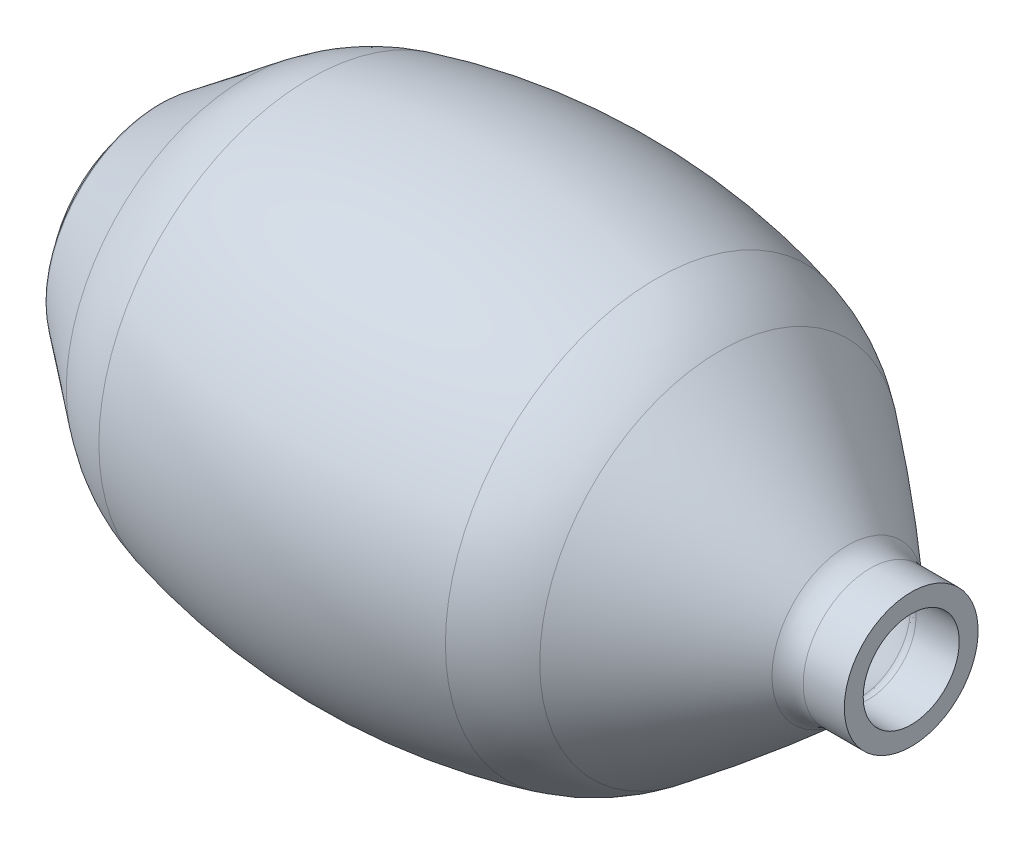
ISO-10303-21;
HEADER;
FILE_DESCRIPTION(('STEP AP214'),'2;1');
FILE_NAME('part.step','',(''),(''),'','','');
FILE_SCHEMA(('AUTOMOTIVE_DESIGN { 1 0 10303 214 1 1 1 1 }'));
ENDSEC;
DATA;
#1=APPLICATION_CONTEXT('core data for automotive mechanical design processes');
#2=APPLICATION_PROTOCOL_DEFINITION('international standard','automotive_design',2000,#1);
#3=PRODUCT_CONTEXT('',#1,'mechanical');
#4=PRODUCT('Part','Part','',(#3));
#5=PRODUCT_RELATED_PRODUCT_CATEGORY('part','',(#4));
#6=PRODUCT_DEFINITION_FORMATION('','',#4);
#7=PRODUCT_DEFINITION_CONTEXT('part definition',#1,'design');
#8=PRODUCT_DEFINITION('design','',#6,#7);
#9=PRODUCT_DEFINITION_SHAPE('','',#8);
#10=(LENGTH_UNIT() NAMED_UNIT(*) SI_UNIT(.MILLI.,.METRE.));
#11=(NAMED_UNIT(*) PLANE_ANGLE_UNIT() SI_UNIT($,.RADIAN.));
#12=(NAMED_UNIT(*) SI_UNIT($,.STERADIAN.) SOLID_ANGLE_UNIT());
#13=UNCERTAINTY_MEASURE_WITH_UNIT(LENGTH_MEASURE(1.E-05),#10,'distance_accuracy_value','');
#14=(GEOMETRIC_REPRESENTATION_CONTEXT(3) GLOBAL_UNCERTAINTY_ASSIGNED_CONTEXT((#13)) GLOBAL_UNIT_ASSIGNED_CONTEXT((#10,
#11,#12)) REPRESENTATION_CONTEXT('',''));
#15=CARTESIAN_POINT('',(0.,0.,0.));
#16=DIRECTION('',(0.,0.,1.));
#17=DIRECTION('',(1.,0.,0.));
#18=AXIS2_PLACEMENT_3D('',#15,#16,#17);
#19=CARTESIAN_POINT('',(37.4010395541845,0.,0.));
#20=DIRECTION('',(-1.,0.,0.));
#21=DIRECTION('',(0.,0.,1.));
#22=AXIS2_PLACEMENT_3D('',#19,#20,#21);
#23=DEGENERATE_TOROIDAL_SURFACE('',#22,11.060470194713,52.1126561570169,.T.);
#24=CARTESIAN_POINT('',(50.5,0.,0.));
#25=DIRECTION('',(-1.,0.,0.));
#26=DIRECTION('',(0.,0.,1.));
#27=AXIS2_PLACEMENT_3D('',#24,#25,#26);
#28=CIRCLE('',#27,61.5);
#29=CARTESIAN_POINT('',(50.5,0.,61.5));
#30=VERTEX_POINT('',#29);
#31=EDGE_CURVE('E10',#30,#30,#28,.T.);
#32=ORIENTED_EDGE('',*,*,#31,.F.);
#33=EDGE_LOOP('',(#32));
#34=FACE_BOUND('',#33,.T.);
#35=CARTESIAN_POINT('',(69.0000000000001,0.,0.));
#36=DIRECTION('',(-1.,0.,0.));
#37=DIRECTION('',(0.,0.,1.));
#38=AXIS2_PLACEMENT_3D('',#35,#36,#37);
#39=CIRCLE('',#38,52.5);
#40=CARTESIAN_POINT('',(69.0000000000001,0.,52.5));
#41=VERTEX_POINT('',#40);
#42=EDGE_CURVE('E126',#41,#41,#39,.T.);
#43=ORIENTED_EDGE('',*,*,#42,.T.);
#44=EDGE_LOOP('',(#43));
#45=FACE_BOUND('',#44,.T.);
#46=ADVANCED_FACE('F32',(#34,#45),#23,.T.);
#47=CARTESIAN_POINT('',(0.,0.,0.));
#48=DIRECTION('',(-1.,0.,0.));
#49=DIRECTION('',(0.,0.,1.));
#50=AXIS2_PLACEMENT_3D('',#47,#48,#49);
#51=DEGENERATE_TOROIDAL_SURFACE('',#50,132.957893487317,200.908243582797,.F.);
#52=CARTESIAN_POINT('',(-50.5,0.,0.));
#53=DIRECTION('',(-1.,0.,0.));
#54=DIRECTION('',(0.,0.,1.));
#55=AXIS2_PLACEMENT_3D('',#52,#53,#54);
#56=CIRCLE('',#55,61.5);
#57=CARTESIAN_POINT('',(-50.5,0.,61.5));
#58=VERTEX_POINT('',#57);
#59=EDGE_CURVE('E38',#58,#58,#56,.T.);
#60=ORIENTED_EDGE('',*,*,#59,.F.);
#61=EDGE_LOOP('',(#60));
#62=FACE_BOUND('',#61,.T.);
#63=ORIENTED_EDGE('',*,*,#31,.T.);
#64=EDGE_LOOP('',(#63));
#65=FACE_BOUND('',#64,.T.);
#66=ADVANCED_FACE('F295',(#62,#65),#51,.F.);
#67=CARTESIAN_POINT('',(-37.4010395541845,0.,0.));
#68=DIRECTION('',(-1.,0.,0.));
#69=DIRECTION('',(0.,0.,1.));
#70=AXIS2_PLACEMENT_3D('',#67,#68,#69);
#71=DEGENERATE_TOROIDAL_SURFACE('',#70,11.060470194713,52.1126561570169,.T.);
#72=CARTESIAN_POINT('',(-69.,0.,0.));
#73=DIRECTION('',(-1.,0.,0.));
#74=DIRECTION('',(0.,0.,1.));
#75=AXIS2_PLACEMENT_3D('',#72,#73,#74);
#76=CIRCLE('',#75,52.5);
#77=CARTESIAN_POINT('',(-69.,0.,52.5));
#78=VERTEX_POINT('',#77);
#79=EDGE_CURVE('E42',#78,#78,#76,.T.);
#80=ORIENTED_EDGE('',*,*,#79,.F.);
#81=EDGE_LOOP('',(#80));
#82=FACE_BOUND('',#81,.T.);
#83=ORIENTED_EDGE('',*,*,#59,.T.);
#84=EDGE_LOOP('',(#83));
#85=FACE_BOUND('',#84,.T.);
#86=ADVANCED_FACE('F290',(#82,#85),#71,.T.);
#87=CARTESIAN_POINT('',(-69.,0.,0.));
#88=DIRECTION('',(1.,0.,0.));
#89=DIRECTION('',(0.,0.,-1.));
#90=AXIS2_PLACEMENT_3D('',#87,#88,#89);
#91=CONICAL_SURFACE('',#90,52.5,0.651473354019808);
#92=CARTESIAN_POINT('',(-93.6538480001091,0.,0.));
#93=DIRECTION('',(-1.,0.,0.));
#94=DIRECTION('',(0.,0.,1.));
#95=AXIS2_PLACEMENT_3D('',#92,#93,#94);
#96=CIRCLE('',#95,33.7006561982466);
#97=CARTESIAN_POINT('',(-93.6538480001091,0.,33.7006561982466));
#98=VERTEX_POINT('',#97);
#99=EDGE_CURVE('E46',#98,#98,#96,.T.);
#100=ORIENTED_EDGE('',*,*,#99,.F.);
#101=EDGE_LOOP('',(#100));
#102=FACE_BOUND('',#101,.T.);
#103=ORIENTED_EDGE('',*,*,#79,.T.);
#104=EDGE_LOOP('',(#103));
#105=FACE_BOUND('',#104,.T.);
#106=ADVANCED_FACE('F284',(#102,#105),#91,.T.);
#107=CARTESIAN_POINT('',(-91.2284133532466,0.,0.));
#108=DIRECTION('',(-1.,0.,0.));
#109=DIRECTION('',(0.,0.,1.));
#110=AXIS2_PLACEMENT_3D('',#107,#108,#109);
#111=TOROIDAL_SURFACE('',#110,30.5198910742868,4.);
#112=CARTESIAN_POINT('',(-95.2284133532466,0.,0.));
#113=DIRECTION('',(-1.,0.,0.));
#114=DIRECTION('',(0.,0.,1.));
#115=AXIS2_PLACEMENT_3D('',#112,#113,#114);
#116=CIRCLE('',#115,30.5198910742868);
#117=CARTESIAN_POINT('',(-95.2284133532466,0.,30.5198910742868));
#118=VERTEX_POINT('',#117);
#119=EDGE_CURVE('E51',#118,#118,#116,.T.);
#120=ORIENTED_EDGE('',*,*,#119,.F.);
#121=EDGE_LOOP('',(#120));
#122=FACE_BOUND('',#121,.T.);
#123=ORIENTED_EDGE('',*,*,#99,.T.);
#124=EDGE_LOOP('',(#123));
#125=FACE_BOUND('',#124,.T.);
#126=ADVANCED_FACE('F278',(#122,#125),#111,.T.);
#127=CARTESIAN_POINT('',(-95.2284133532466,0.,-30.5198910742868));
#128=DIRECTION('',(1.,0.,0.));
#129=DIRECTION('',(0.,0.,-1.));
#130=AXIS2_PLACEMENT_3D('',#127,#128,#129);
#131=PLANE('',#130);
#132=CARTESIAN_POINT('',(-95.2284133532466,0.,0.));
#133=DIRECTION('',(-1.,0.,0.));
#134=DIRECTION('',(0.,0.,1.));
#135=AXIS2_PLACEMENT_3D('',#132,#133,#134);
#136=CIRCLE('',#135,28.);
#137=CARTESIAN_POINT('',(-95.2284133532466,0.,28.));
#138=VERTEX_POINT('',#137);
#139=EDGE_CURVE('E54',#138,#138,#136,.T.);
#140=ORIENTED_EDGE('',*,*,#139,.F.);
#141=EDGE_LOOP('',(#140));
#142=FACE_BOUND('',#141,.T.);
#143=ORIENTED_EDGE('',*,*,#119,.T.);
#144=EDGE_LOOP('',(#143));
#145=FACE_BOUND('',#144,.T.);
#146=ADVANCED_FACE('F272',(#142,#145),#131,.F.);
#147=CARTESIAN_POINT('',(0.,0.,0.));
#148=DIRECTION('',(-1.,0.,0.));
#149=DIRECTION('',(0.,0.,1.));
#150=AXIS2_PLACEMENT_3D('',#147,#148,#149);
#151=CYLINDRICAL_SURFACE('',#150,28.);
#152=CARTESIAN_POINT('',(-98.2284133532466,0.,0.));
#153=DIRECTION('',(-1.,0.,0.));
#154=DIRECTION('',(0.,0.,1.));
#155=AXIS2_PLACEMENT_3D('',#152,#153,#154);
#156=CIRCLE('',#155,28.);
#157=CARTESIAN_POINT('',(-98.2284133532466,0.,28.));
#158=VERTEX_POINT('',#157);
#159=EDGE_CURVE('E57',#158,#158,#156,.T.);
#160=ORIENTED_EDGE('',*,*,#159,.F.);
#161=EDGE_LOOP('',(#160));
#162=FACE_BOUND('',#161,.T.);
#163=ORIENTED_EDGE('',*,*,#139,.T.);
#164=EDGE_LOOP('',(#163));
#165=FACE_BOUND('',#164,.T.);
#166=ADVANCED_FACE('F266',(#162,#165),#151,.T.);
#167=CARTESIAN_POINT('',(-98.2284133532466,0.,-28.));
#168=DIRECTION('',(1.,0.,0.));
#169=DIRECTION('',(0.,0.,-1.));
#170=AXIS2_PLACEMENT_3D('',#167,#168,#169);
#171=PLANE('',#170);
#172=CARTESIAN_POINT('',(-98.2284133532466,0.,0.));
#173=DIRECTION('',(-1.,0.,0.));
#174=DIRECTION('',(0.,0.,1.));
#175=AXIS2_PLACEMENT_3D('',#172,#173,#174);
#176=CIRCLE('',#175,25.5);
#177=CARTESIAN_POINT('',(-98.2284133532466,0.,25.5));
#178=VERTEX_POINT('',#177);
#179=EDGE_CURVE('E60',#178,#178,#176,.T.);
#180=ORIENTED_EDGE('',*,*,#179,.F.);
#181=EDGE_LOOP('',(#180));
#182=FACE_BOUND('',#181,.T.);
#183=ORIENTED_EDGE('',*,*,#159,.T.);
#184=EDGE_LOOP('',(#183));
#185=FACE_BOUND('',#184,.T.);
#186=ADVANCED_FACE('F260',(#182,#185),#171,.F.);
#187=CARTESIAN_POINT('',(0.,0.,0.));
#188=DIRECTION('',(-1.,0.,0.));
#189=DIRECTION('',(0.,0.,1.));
#190=AXIS2_PLACEMENT_3D('',#187,#188,#189);
#191=CYLINDRICAL_SURFACE('',#190,25.5);
#192=CARTESIAN_POINT('',(-92.2284133532466,0.,0.));
#193=DIRECTION('',(-1.,0.,0.));
#194=DIRECTION('',(0.,0.,1.));
#195=AXIS2_PLACEMENT_3D('',#192,#193,#194);
#196=CIRCLE('',#195,25.5);
#197=CARTESIAN_POINT('',(-92.2284133532466,0.,25.5));
#198=VERTEX_POINT('',#197);
#199=EDGE_CURVE('E63',#198,#198,#196,.T.);
#200=ORIENTED_EDGE('',*,*,#199,.F.);
#201=EDGE_LOOP('',(#200));
#202=FACE_BOUND('',#201,.T.);
#203=ORIENTED_EDGE('',*,*,#179,.T.);
#204=EDGE_LOOP('',(#203));
#205=FACE_BOUND('',#204,.T.);
#206=ADVANCED_FACE('F254',(#202,#205),#191,.F.);
#207=CARTESIAN_POINT('',(-92.2284133532466,0.,-30.5198910742868));
#208=DIRECTION('',(-1.,0.,0.));
#209=DIRECTION('',(0.,0.,1.));
#210=AXIS2_PLACEMENT_3D('',#207,#208,#209);
#211=PLANE('',#210);
#212=CARTESIAN_POINT('',(-92.2284133532466,0.,0.));
#213=DIRECTION('',(-1.,0.,0.));
#214=DIRECTION('',(0.,0.,1.));
#215=AXIS2_PLACEMENT_3D('',#212,#213,#214);
#216=CIRCLE('',#215,30.5198910742868);
#217=CARTESIAN_POINT('',(-92.2284133532466,0.,30.5198910742868));
#218=VERTEX_POINT('',#217);
#219=EDGE_CURVE('E66',#218,#218,#216,.T.);
#220=ORIENTED_EDGE('',*,*,#219,.F.);
#221=EDGE_LOOP('',(#220));
#222=FACE_BOUND('',#221,.T.);
#223=ORIENTED_EDGE('',*,*,#199,.T.);
#224=EDGE_LOOP('',(#223));
#225=FACE_BOUND('',#224,.T.);
#226=ADVANCED_FACE('F248',(#222,#225),#211,.F.);
#227=CARTESIAN_POINT('',(-91.2284133532466,0.,0.));
#228=DIRECTION('',(-1.,0.,0.));
#229=DIRECTION('',(0.,0.,1.));
#230=AXIS2_PLACEMENT_3D('',#227,#228,#229);
#231=TOROIDAL_SURFACE('',#230,30.5198910742868,1.);
#232=CARTESIAN_POINT('',(-91.8347720149623,0.,0.));
#233=DIRECTION('',(-1.,0.,0.));
#234=DIRECTION('',(0.,0.,1.));
#235=AXIS2_PLACEMENT_3D('',#232,#233,#234);
#236=CIRCLE('',#235,31.3150823552768);
#237=CARTESIAN_POINT('',(-91.8347720149623,0.,31.3150823552768));
#238=VERTEX_POINT('',#237);
#239=EDGE_CURVE('E69',#238,#238,#236,.T.);
#240=ORIENTED_EDGE('',*,*,#239,.F.);
#241=EDGE_LOOP('',(#240));
#242=FACE_BOUND('',#241,.T.);
#243=ORIENTED_EDGE('',*,*,#219,.T.);
#244=EDGE_LOOP('',(#243));
#245=FACE_BOUND('',#244,.T.);
#246=ADVANCED_FACE('F242',(#242,#245),#231,.F.);
#247=CARTESIAN_POINT('',(-91.8347720149623,0.,0.));
#248=DIRECTION('',(1.,0.,0.));
#249=DIRECTION('',(0.,0.,-1.));
#250=AXIS2_PLACEMENT_3D('',#247,#248,#249);
#251=CONICAL_SURFACE('',#250,31.3150823552768,0.651473354019809);
#252=CARTESIAN_POINT('',(-67.1809240148531,0.,0.));
#253=DIRECTION('',(-1.,0.,0.));
#254=DIRECTION('',(0.,0.,1.));
#255=AXIS2_PLACEMENT_3D('',#252,#253,#254);
#256=CIRCLE('',#255,50.1144261570302);
#257=CARTESIAN_POINT('',(-67.1809240148531,0.,50.1144261570302));
#258=VERTEX_POINT('',#257);
#259=EDGE_CURVE('E72',#258,#258,#256,.T.);
#260=ORIENTED_EDGE('',*,*,#259,.F.);
#261=EDGE_LOOP('',(#260));
#262=FACE_BOUND('',#261,.T.);
#263=ORIENTED_EDGE('',*,*,#239,.T.);
#264=EDGE_LOOP('',(#263));
#265=FACE_BOUND('',#264,.T.);
#266=ADVANCED_FACE('F236',(#262,#265),#251,.F.);
#267=CARTESIAN_POINT('',(-67.7872826765687,0.,0.));
#268=DIRECTION('',(-1.,0.,0.));
#269=DIRECTION('',(0.,0.,1.));
#270=AXIS2_PLACEMENT_3D('',#267,#268,#269);
#271=TOROIDAL_SURFACE('',#270,50.9096174380201,0.999999999999743);
#272=CARTESIAN_POINT('',(-66.7923580735737,0.,0.));
#273=DIRECTION('',(-1.,0.,0.));
#274=DIRECTION('',(0.,0.,1.));
#275=AXIS2_PLACEMENT_3D('',#272,#273,#274);
#276=CIRCLE('',#275,50.8089942083231);
#277=CARTESIAN_POINT('',(-66.7923580735737,0.,50.8089942083231));
#278=VERTEX_POINT('',#277);
#279=EDGE_CURVE('E75',#278,#278,#276,.T.);
#280=ORIENTED_EDGE('',*,*,#279,.F.);
#281=EDGE_LOOP('',(#280));
#282=FACE_BOUND('',#281,.T.);
#283=ORIENTED_EDGE('',*,*,#259,.T.);
#284=EDGE_LOOP('',(#283));
#285=FACE_BOUND('',#284,.T.);
#286=ADVANCED_FACE('F230',(#282,#285),#271,.T.);
#287=CARTESIAN_POINT('',(-64.8025088675833,0.,0.));
#288=DIRECTION('',(-1.,0.,0.));
#289=DIRECTION('',(0.,0.,1.));
#290=AXIS2_PLACEMENT_3D('',#287,#288,#289);
#291=TOROIDAL_SURFACE('',#290,50.6077477489291,2.);
#292=CARTESIAN_POINT('',(-65.9415633909492,0.,0.));
#293=DIRECTION('',(-1.,0.,0.));
#294=DIRECTION('',(0.,0.,1.));
#295=AXIS2_PLACEMENT_3D('',#292,#293,#294);
#296=CIRCLE('',#295,52.2516926363264);
#297=CARTESIAN_POINT('',(-65.9415633909492,0.,52.2516926363264));
#298=VERTEX_POINT('',#297);
#299=EDGE_CURVE('E78',#298,#298,#296,.T.);
#300=ORIENTED_EDGE('',*,*,#299,.F.);
#301=EDGE_LOOP('',(#300));
#302=FACE_BOUND('',#301,.T.);
#303=ORIENTED_EDGE('',*,*,#279,.T.);
#304=EDGE_LOOP('',(#303));
#305=FACE_BOUND('',#304,.T.);
#306=ADVANCED_FACE('F224',(#302,#305),#291,.F.);
#307=CARTESIAN_POINT('',(-37.4010395541845,0.,0.));
#308=DIRECTION('',(-1.,0.,0.));
#309=DIRECTION('',(0.,0.,1.));
#310=AXIS2_PLACEMENT_3D('',#307,#308,#309);
#311=DEGENERATE_TOROIDAL_SURFACE('',#310,11.060470194713,50.1126561570169,.T.);
#312=CARTESIAN_POINT('',(-52.1924517708474,0.,0.));
#313=DIRECTION('',(-1.,0.,0.));
#314=DIRECTION('',(0.,0.,1.));
#315=AXIS2_PLACEMENT_3D('',#312,#313,#314);
#316=CIRCLE('',#315,58.9404496407003);
#317=CARTESIAN_POINT('',(-52.1924517708474,0.,58.9404496407003));
#318=VERTEX_POINT('',#317);
#319=EDGE_CURVE('E81',#318,#318,#316,.T.);
#320=ORIENTED_EDGE('',*,*,#319,.F.);
#321=EDGE_LOOP('',(#320));
#322=FACE_BOUND('',#321,.T.);
#323=ORIENTED_EDGE('',*,*,#299,.T.);
#324=EDGE_LOOP('',(#323));
#325=FACE_BOUND('',#324,.T.);
#326=ADVANCED_FACE('F218',(#322,#325),#311,.F.);
#327=CARTESIAN_POINT('',(-51.6021253602769,0.,0.));
#328=DIRECTION('',(-1.,0.,0.));
#329=DIRECTION('',(0.,0.,1.));
#330=AXIS2_PLACEMENT_3D('',#327,#328,#329);
#331=TOROIDAL_SURFACE('',#330,57.0295559416728,2.);
#332=CARTESIAN_POINT('',(-50.5322304185479,0.,0.));
#333=DIRECTION('',(-1.,0.,0.));
#334=DIRECTION('',(0.,0.,1.));
#335=AXIS2_PLACEMENT_3D('',#332,#333,#334);
#336=CIRCLE('',#335,58.7193265810386);
#337=CARTESIAN_POINT('',(-50.5322304185479,0.,58.7193265810386));
#338=VERTEX_POINT('',#337);
#339=EDGE_CURVE('E84',#338,#338,#336,.T.);
#340=ORIENTED_EDGE('',*,*,#339,.F.);
#341=EDGE_LOOP('',(#340));
#342=FACE_BOUND('',#341,.T.);
#343=ORIENTED_EDGE('',*,*,#319,.T.);
#344=EDGE_LOOP('',(#343));
#345=FACE_BOUND('',#344,.T.);
#346=ADVANCED_FACE('F212',(#342,#345),#331,.F.);
#347=CARTESIAN_POINT('',(-49.9972829476837,0.,0.));
#348=DIRECTION('',(-1.,0.,0.));
#349=DIRECTION('',(0.,0.,1.));
#350=AXIS2_PLACEMENT_3D('',#347,#348,#349);
#351=TOROIDAL_SURFACE('',#350,59.564211900721,0.999999999999747);
#352=CARTESIAN_POINT('',(-49.7459244215255,0.,0.));
#353=DIRECTION('',(-1.,0.,0.));
#354=DIRECTION('',(0.,0.,1.));
#355=AXIS2_PLACEMENT_3D('',#352,#353,#354);
#356=CIRCLE('',#355,58.5963178510817);
#357=CARTESIAN_POINT('',(-49.7459244215255,0.,58.5963178510817));
#358=VERTEX_POINT('',#357);
#359=EDGE_CURVE('E87',#358,#358,#356,.T.);
#360=ORIENTED_EDGE('',*,*,#359,.F.);
#361=EDGE_LOOP('',(#360));
#362=FACE_BOUND('',#361,.T.);
#363=ORIENTED_EDGE('',*,*,#339,.T.);
#364=EDGE_LOOP('',(#363));
#365=FACE_BOUND('',#364,.T.);
#366=ADVANCED_FACE('F206',(#362,#365),#351,.T.);
#367=CARTESIAN_POINT('',(0.,0.,0.));
#368=DIRECTION('',(-1.,0.,0.));
#369=DIRECTION('',(0.,0.,1.));
#370=AXIS2_PLACEMENT_3D('',#367,#368,#369);
#371=DEGENERATE_TOROIDAL_SURFACE('',#370,132.957893487317,197.908243582797,.F.);
#372=CARTESIAN_POINT('',(49.7459244215255,0.,0.));
#373=DIRECTION('',(-1.,0.,0.));
#374=DIRECTION('',(0.,0.,1.));
#375=AXIS2_PLACEMENT_3D('',#372,#373,#374);
#376=CIRCLE('',#375,58.5963178510814);
#377=CARTESIAN_POINT('',(49.7459244215255,0.,58.5963178510814));
#378=VERTEX_POINT('',#377);
#379=EDGE_CURVE('E90',#378,#378,#376,.T.);
#380=ORIENTED_EDGE('',*,*,#379,.F.);
#381=EDGE_LOOP('',(#380));
#382=FACE_BOUND('',#381,.T.);
#383=ORIENTED_EDGE('',*,*,#359,.T.);
#384=EDGE_LOOP('',(#383));
#385=FACE_BOUND('',#384,.T.);
#386=ADVANCED_FACE('F200',(#382,#385),#371,.T.);
#387=CARTESIAN_POINT('',(49.9972829476837,0.,0.));
#388=DIRECTION('',(-1.,0.,0.));
#389=DIRECTION('',(0.,0.,1.));
#390=AXIS2_PLACEMENT_3D('',#387,#388,#389);
#391=TOROIDAL_SURFACE('',#390,59.564211900721,1.00000000000006);
#392=CARTESIAN_POINT('',(50.5322304185484,0.,0.));
#393=DIRECTION('',(-1.,0.,0.));
#394=DIRECTION('',(0.,0.,1.));
#395=AXIS2_PLACEMENT_3D('',#392,#393,#394);
#396=CIRCLE('',#395,58.7193265810381);
#397=CARTESIAN_POINT('',(50.5322304185484,0.,58.7193265810381));
#398=VERTEX_POINT('',#397);
#399=EDGE_CURVE('E93',#398,#398,#396,.T.);
#400=ORIENTED_EDGE('',*,*,#399,.F.);
#401=EDGE_LOOP('',(#400));
#402=FACE_BOUND('',#401,.T.);
#403=ORIENTED_EDGE('',*,*,#379,.T.);
#404=EDGE_LOOP('',(#403));
#405=FACE_BOUND('',#404,.T.);
#406=ADVANCED_FACE('F194',(#402,#405),#391,.T.);
#407=CARTESIAN_POINT('',(51.6021253602777,0.,0.));
#408=DIRECTION('',(-1.,0.,0.));
#409=DIRECTION('',(0.,0.,1.));
#410=AXIS2_PLACEMENT_3D('',#407,#408,#409);
#411=TOROIDAL_SURFACE('',#410,57.0295559416726,2.);
#412=CARTESIAN_POINT('',(52.1924517708483,0.,0.));
#413=DIRECTION('',(-1.,0.,0.));
#414=DIRECTION('',(0.,0.,1.));
#415=AXIS2_PLACEMENT_3D('',#412,#413,#414);
#416=CIRCLE('',#415,58.9404496407);
#417=CARTESIAN_POINT('',(52.1924517708483,0.,58.9404496407));
#418=VERTEX_POINT('',#417);
#419=EDGE_CURVE('E96',#418,#418,#416,.T.);
#420=ORIENTED_EDGE('',*,*,#419,.F.);
#421=EDGE_LOOP('',(#420));
#422=FACE_BOUND('',#421,.T.);
#423=ORIENTED_EDGE('',*,*,#399,.T.);
#424=EDGE_LOOP('',(#423));
#425=FACE_BOUND('',#424,.T.);
#426=ADVANCED_FACE('F188',(#422,#425),#411,.F.);
#427=CARTESIAN_POINT('',(37.4010395541845,0.,0.));
#428=DIRECTION('',(-1.,0.,0.));
#429=DIRECTION('',(0.,0.,1.));
#430=AXIS2_PLACEMENT_3D('',#427,#428,#429);
#431=DEGENERATE_TOROIDAL_SURFACE('',#430,11.060470194713,50.1126561570169,.T.);
#432=CARTESIAN_POINT('',(65.9415633909492,0.,0.));
#433=DIRECTION('',(-1.,0.,0.));
#434=DIRECTION('',(0.,0.,1.));
#435=AXIS2_PLACEMENT_3D('',#432,#433,#434);
#436=CIRCLE('',#435,52.2516926363264);
#437=CARTESIAN_POINT('',(65.9415633909492,0.,52.2516926363264));
#438=VERTEX_POINT('',#437);
#439=EDGE_CURVE('E99',#438,#438,#436,.T.);
#440=ORIENTED_EDGE('',*,*,#439,.F.);
#441=EDGE_LOOP('',(#440));
#442=FACE_BOUND('',#441,.T.);
#443=ORIENTED_EDGE('',*,*,#419,.T.);
#444=EDGE_LOOP('',(#443));
#445=FACE_BOUND('',#444,.T.);
#446=ADVANCED_FACE('F182',(#442,#445),#431,.F.);
#447=CARTESIAN_POINT('',(64.8025088675833,0.,0.));
#448=DIRECTION('',(-1.,0.,0.));
#449=DIRECTION('',(0.,0.,1.));
#450=AXIS2_PLACEMENT_3D('',#447,#448,#449);
#451=TOROIDAL_SURFACE('',#450,50.6077477489291,2.);
#452=CARTESIAN_POINT('',(66.7923580735739,0.,0.));
#453=DIRECTION('',(-1.,0.,0.));
#454=DIRECTION('',(0.,0.,1.));
#455=AXIS2_PLACEMENT_3D('',#452,#453,#454);
#456=CIRCLE('',#455,50.8089942083231);
#457=CARTESIAN_POINT('',(66.7923580735739,0.,50.8089942083231));
#458=VERTEX_POINT('',#457);
#459=EDGE_CURVE('E102',#458,#458,#456,.T.);
#460=ORIENTED_EDGE('',*,*,#459,.F.);
#461=EDGE_LOOP('',(#460));
#462=FACE_BOUND('',#461,.T.);
#463=ORIENTED_EDGE('',*,*,#439,.T.);
#464=EDGE_LOOP('',(#463));
#465=FACE_BOUND('',#464,.T.);
#466=ADVANCED_FACE('F176',(#462,#465),#451,.F.);
#467=CARTESIAN_POINT('',(67.7872826765687,0.,0.));
#468=DIRECTION('',(-1.,0.,0.));
#469=DIRECTION('',(0.,0.,1.));
#470=AXIS2_PLACEMENT_3D('',#467,#468,#469);
#471=TOROIDAL_SURFACE('',#470,50.9096174380201,0.999999999999725);
#472=CARTESIAN_POINT('',(67.1809240148532,0.,0.));
#473=DIRECTION('',(-1.,0.,0.));
#474=DIRECTION('',(0.,0.,1.));
#475=AXIS2_PLACEMENT_3D('',#472,#473,#474);
#476=CIRCLE('',#475,50.1144261570304);
#477=CARTESIAN_POINT('',(67.1809240148532,0.,50.1144261570304));
#478=VERTEX_POINT('',#477);
#479=EDGE_CURVE('E105',#478,#478,#476,.T.);
#480=ORIENTED_EDGE('',*,*,#479,.F.);
#481=EDGE_LOOP('',(#480));
#482=FACE_BOUND('',#481,.T.);
#483=ORIENTED_EDGE('',*,*,#459,.T.);
#484=EDGE_LOOP('',(#483));
#485=FACE_BOUND('',#484,.T.);
#486=ADVANCED_FACE('F170',(#482,#485),#471,.T.);
#487=CARTESIAN_POINT('',(-341.298566295638,0.,0.));
#488=DIRECTION('',(-1.,0.,0.));
#489=DIRECTION('',(0.,0.,1.));
#490=AXIS2_PLACEMENT_3D('',#487,#488,#489);
#491=DEGENERATE_TOROIDAL_SURFACE('',#490,485.574019752288,673.659858597096,.F.);
#492=CARTESIAN_POINT('',(109.495902182149,0.,0.));
#493=DIRECTION('',(-1.,0.,0.));
#494=DIRECTION('',(0.,0.,1.));
#495=AXIS2_PLACEMENT_3D('',#492,#493,#494);
#496=CIRCLE('',#495,15.0275706116351);
#497=CARTESIAN_POINT('',(109.495902182149,0.,15.0275706116351));
#498=VERTEX_POINT('',#497);
#499=EDGE_CURVE('E108',#498,#498,#496,.T.);
#500=ORIENTED_EDGE('',*,*,#499,.F.);
#501=EDGE_LOOP('',(#500));
#502=FACE_BOUND('',#501,.T.);
#503=ORIENTED_EDGE('',*,*,#479,.T.);
#504=EDGE_LOOP('',(#503));
#505=FACE_BOUND('',#504,.T.);
#506=ADVANCED_FACE('F164',(#502,#505),#491,.T.);
#507=CARTESIAN_POINT('',(112.172591094067,0.,0.));
#508=DIRECTION('',(-1.,0.,0.));
#509=DIRECTION('',(0.,0.,1.));
#510=AXIS2_PLACEMENT_3D('',#507,#508,#509);
#511=TOROIDAL_SURFACE('',#510,18.,4.00000000000002);
#512=CARTESIAN_POINT('',(112.172591094067,0.,0.));
#513=DIRECTION('',(-1.,0.,0.));
#514=DIRECTION('',(0.,0.,1.));
#515=AXIS2_PLACEMENT_3D('',#512,#513,#514);
#516=CIRCLE('',#515,14.);
#517=CARTESIAN_POINT('',(112.172591094067,0.,14.));
#518=VERTEX_POINT('',#517);
#519=EDGE_CURVE('E111',#518,#518,#516,.T.);
#520=ORIENTED_EDGE('',*,*,#519,.F.);
#521=EDGE_LOOP('',(#520));
#522=FACE_BOUND('',#521,.T.);
#523=ORIENTED_EDGE('',*,*,#499,.T.);
#524=EDGE_LOOP('',(#523));
#525=FACE_BOUND('',#524,.T.);
#526=ADVANCED_FACE('F158',(#522,#525),#511,.T.);
#527=CARTESIAN_POINT('',(0.,0.,0.));
#528=DIRECTION('',(-1.,0.,0.));
#529=DIRECTION('',(0.,0.,1.));
#530=AXIS2_PLACEMENT_3D('',#527,#528,#529);
#531=CYLINDRICAL_SURFACE('',#530,14.);
#532=CARTESIAN_POINT('',(124.771586646753,0.,0.));
#533=DIRECTION('',(-1.,0.,0.));
#534=DIRECTION('',(0.,0.,1.));
#535=AXIS2_PLACEMENT_3D('',#532,#533,#534);
#536=CIRCLE('',#535,14.);
#537=CARTESIAN_POINT('',(124.771586646753,0.,14.));
#538=VERTEX_POINT('',#537);
#539=EDGE_CURVE('E114',#538,#538,#536,.T.);
#540=ORIENTED_EDGE('',*,*,#539,.F.);
#541=EDGE_LOOP('',(#540));
#542=FACE_BOUND('',#541,.T.);
#543=ORIENTED_EDGE('',*,*,#519,.T.);
#544=EDGE_LOOP('',(#543));
#545=FACE_BOUND('',#544,.T.);
#546=ADVANCED_FACE('F152',(#542,#545),#531,.F.);
#547=CARTESIAN_POINT('',(124.771586646753,0.,-19.5));
#548=DIRECTION('',(-1.,0.,0.));
#549=DIRECTION('',(0.,0.,1.));
#550=AXIS2_PLACEMENT_3D('',#547,#548,#549);
#551=PLANE('',#550);
#552=CARTESIAN_POINT('',(124.771586646753,0.,0.));
#553=DIRECTION('',(-1.,0.,0.));
#554=DIRECTION('',(0.,0.,1.));
#555=AXIS2_PLACEMENT_3D('',#552,#553,#554);
#556=CIRCLE('',#555,19.5);
#557=CARTESIAN_POINT('',(124.771586646753,0.,19.5));
#558=VERTEX_POINT('',#557);
#559=EDGE_CURVE('E117',#558,#558,#556,.T.);
#560=ORIENTED_EDGE('',*,*,#559,.F.);
#561=EDGE_LOOP('',(#560));
#562=FACE_BOUND('',#561,.T.);
#563=ORIENTED_EDGE('',*,*,#539,.T.);
#564=EDGE_LOOP('',(#563));
#565=FACE_BOUND('',#564,.T.);
#566=ADVANCED_FACE('F146',(#562,#565),#551,.F.);
#567=CARTESIAN_POINT('',(0.,0.,0.));
#568=DIRECTION('',(-1.,0.,0.));
#569=DIRECTION('',(0.,0.,1.));
#570=AXIS2_PLACEMENT_3D('',#567,#568,#569);
#571=CYLINDRICAL_SURFACE('',#570,19.5);
#572=CARTESIAN_POINT('',(112.79450300272,0.,0.));
#573=DIRECTION('',(-1.,0.,0.));
#574=DIRECTION('',(0.,0.,1.));
#575=AXIS2_PLACEMENT_3D('',#572,#573,#574);
#576=CIRCLE('',#575,19.5);
#577=CARTESIAN_POINT('',(112.79450300272,0.,19.5));
#578=VERTEX_POINT('',#577);
#579=EDGE_CURVE('E120',#578,#578,#576,.T.);
#580=ORIENTED_EDGE('',*,*,#579,.F.);
#581=EDGE_LOOP('',(#580));
#582=FACE_BOUND('',#581,.T.);
#583=ORIENTED_EDGE('',*,*,#559,.T.);
#584=EDGE_LOOP('',(#583));
#585=FACE_BOUND('',#584,.T.);
#586=ADVANCED_FACE('F140',(#582,#585),#571,.T.);
#587=CARTESIAN_POINT('',(112.79450300272,0.,0.));
#588=DIRECTION('',(-1.,0.,0.));
#589=DIRECTION('',(0.,0.,1.));
#590=AXIS2_PLACEMENT_3D('',#587,#588,#589);
#591=TOROIDAL_SURFACE('',#590,29.5,9.99999999999998);
#592=CARTESIAN_POINT('',(106.181431572768,0.,0.));
#593=DIRECTION('',(-1.,0.,0.));
#594=DIRECTION('',(0.,0.,1.));
#595=AXIS2_PLACEMENT_3D('',#592,#593,#594);
#596=CIRCLE('',#595,21.9988476710343);
#597=CARTESIAN_POINT('',(106.181431572768,0.,21.9988476710343));
#598=VERTEX_POINT('',#597);
#599=EDGE_CURVE('E123',#598,#598,#596,.T.);
#600=ORIENTED_EDGE('',*,*,#599,.F.);
#601=EDGE_LOOP('',(#600));
#602=FACE_BOUND('',#601,.T.);
#603=ORIENTED_EDGE('',*,*,#579,.T.);
#604=EDGE_LOOP('',(#603));
#605=FACE_BOUND('',#604,.T.);
#606=ADVANCED_FACE('F134',(#602,#605),#591,.F.);
#607=CARTESIAN_POINT('',(-341.298566295638,0.,0.));
#608=DIRECTION('',(-1.,0.,0.));
#609=DIRECTION('',(0.,0.,1.));
#610=AXIS2_PLACEMENT_3D('',#607,#608,#609);
#611=DEGENERATE_TOROIDAL_SURFACE('',#610,485.574019752288,676.659858597096,.F.);
#612=ORIENTED_EDGE('',*,*,#42,.F.);
#613=EDGE_LOOP('',(#612));
#614=FACE_BOUND('',#613,.T.);
#615=ORIENTED_EDGE('',*,*,#599,.T.);
#616=EDGE_LOOP('',(#615));
#617=FACE_BOUND('',#616,.T.);
#618=ADVANCED_FACE('F131',(#614,#617),#611,.F.);
#619=CLOSED_SHELL('',(#46,#66,#86,#106,#126,#146,#166,#186,#206,#226,#246,#266,#286,#306,#326,
#346,#366,#386,#406,#426,#446,#466,#486,#506,#526,#546,#566,#586,#606,#618));
#620=MANIFOLD_SOLID_BREP('B2',#619);
#621=ADVANCED_BREP_SHAPE_REPRESENTATION('',(#18,#620),#14);
#622=SHAPE_DEFINITION_REPRESENTATION(#9,#621);
ENDSEC;
END-ISO-10303-21;
